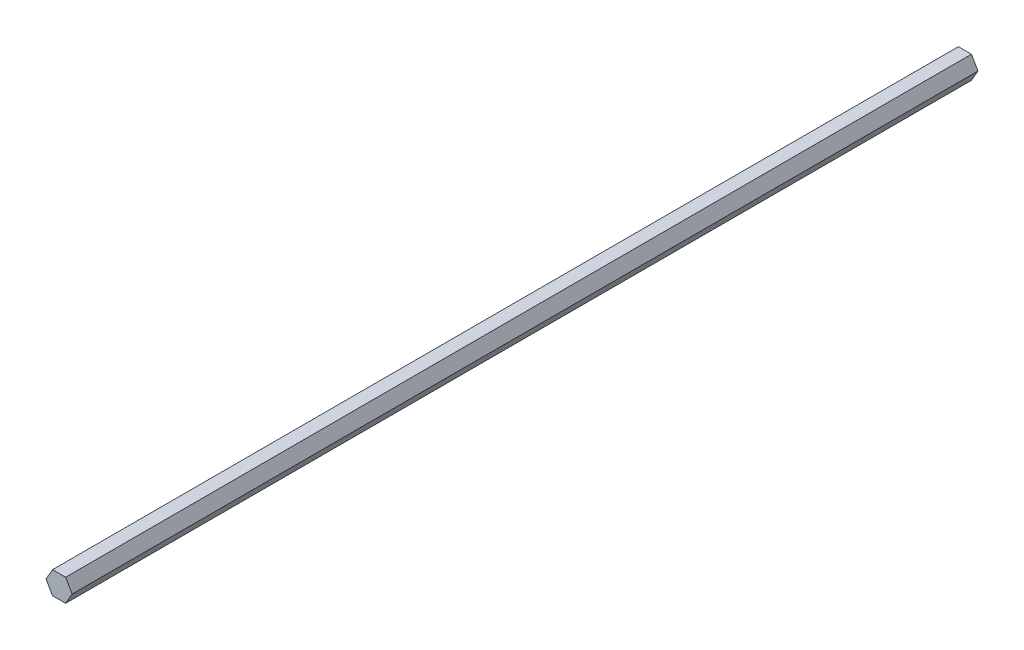
ISO-10303-21;
HEADER;
FILE_DESCRIPTION(('STEP AP214'),'2;1');
FILE_NAME('part.step','',(''),(''),'','','');
FILE_SCHEMA(('AUTOMOTIVE_DESIGN { 1 0 10303 214 1 1 1 1 }'));
ENDSEC;
DATA;
#1=APPLICATION_CONTEXT('core data for automotive mechanical design processes');
#2=APPLICATION_PROTOCOL_DEFINITION('international standard','automotive_design',2000,#1);
#3=PRODUCT_CONTEXT('',#1,'mechanical');
#4=PRODUCT('Part','Part','',(#3));
#5=PRODUCT_RELATED_PRODUCT_CATEGORY('part','',(#4));
#6=PRODUCT_DEFINITION_FORMATION('','',#4);
#7=PRODUCT_DEFINITION_CONTEXT('part definition',#1,'design');
#8=PRODUCT_DEFINITION('design','',#6,#7);
#9=PRODUCT_DEFINITION_SHAPE('','',#8);
#10=(LENGTH_UNIT() NAMED_UNIT(*) SI_UNIT(.MILLI.,.METRE.));
#11=(NAMED_UNIT(*) PLANE_ANGLE_UNIT() SI_UNIT($,.RADIAN.));
#12=(NAMED_UNIT(*) SI_UNIT($,.STERADIAN.) SOLID_ANGLE_UNIT());
#13=UNCERTAINTY_MEASURE_WITH_UNIT(LENGTH_MEASURE(1.E-05),#10,'distance_accuracy_value','');
#14=(GEOMETRIC_REPRESENTATION_CONTEXT(3) GLOBAL_UNCERTAINTY_ASSIGNED_CONTEXT((#13)) GLOBAL_UNIT_ASSIGNED_CONTEXT((#10,
#11,#12)) REPRESENTATION_CONTEXT('',''));
#15=CARTESIAN_POINT('',(0.,0.,0.));
#16=DIRECTION('',(0.,0.,1.));
#17=DIRECTION('',(1.,0.,0.));
#18=AXIS2_PLACEMENT_3D('',#15,#16,#17);
#19=CARTESIAN_POINT('',(3.6661742093542,-6.34999999999996,508.));
#20=DIRECTION('',(-0.866025403784441,0.499999999999995,0.));
#21=DIRECTION('',(-0.499999999999995,-0.866025403784441,0.));
#22=AXIS2_PLACEMENT_3D('',#19,#20,#21);
#23=PLANE('',#22);
#24=DIRECTION('',(0.499999999999995,0.866025403784441,0.));
#25=VECTOR('',#24,1.);
#26=CARTESIAN_POINT('',(3.6661742093542,-6.34999999999996,0.));
#27=LINE('',#26,#25);
#28=CARTESIAN_POINT('',(3.6661742093542,-6.34999999999996,0.));
#29=VERTEX_POINT('',#28);
#30=CARTESIAN_POINT('',(7.33234841870826,0.,0.));
#31=VERTEX_POINT('',#30);
#32=EDGE_CURVE('E120',#29,#31,#27,.T.);
#33=ORIENTED_EDGE('',*,*,#32,.T.);
#34=DIRECTION('',(0.,0.,-1.));
#35=VECTOR('',#34,1.);
#36=CARTESIAN_POINT('',(7.33234841870826,0.,508.));
#37=LINE('',#36,#35);
#38=CARTESIAN_POINT('',(7.33234841870826,0.,508.));
#39=VERTEX_POINT('',#38);
#40=EDGE_CURVE('E11',#39,#31,#37,.T.);
#41=ORIENTED_EDGE('',*,*,#40,.F.);
#42=DIRECTION('',(0.499999999999995,0.866025403784441,0.));
#43=VECTOR('',#42,1.);
#44=CARTESIAN_POINT('',(3.6661742093542,-6.34999999999996,508.));
#45=LINE('',#44,#43);
#46=CARTESIAN_POINT('',(3.6661742093542,-6.34999999999996,508.));
#47=VERTEX_POINT('',#46);
#48=EDGE_CURVE('E130',#47,#39,#45,.T.);
#49=ORIENTED_EDGE('',*,*,#48,.F.);
#50=DIRECTION('',(0.,0.,-1.));
#51=VECTOR('',#50,1.);
#52=CARTESIAN_POINT('',(3.6661742093542,-6.34999999999996,508.));
#53=LINE('',#52,#51);
#54=EDGE_CURVE('E116',#47,#29,#53,.T.);
#55=ORIENTED_EDGE('',*,*,#54,.T.);
#56=EDGE_LOOP('',(#33,#41,#49,#55));
#57=FACE_BOUND('',#56,.T.);
#58=ADVANCED_FACE('F36',(#57),#23,.F.);
#59=CARTESIAN_POINT('',(7.33234841870826,0.,508.));
#60=DIRECTION('',(-0.866025403784438,-0.500000000000001,0.));
#61=DIRECTION('',(0.500000000000001,-0.866025403784438,0.));
#62=AXIS2_PLACEMENT_3D('',#59,#60,#61);
#63=PLANE('',#62);
#64=DIRECTION('',(-0.500000000000001,0.866025403784438,0.));
#65=VECTOR('',#64,1.);
#66=CARTESIAN_POINT('',(7.33234841870826,0.,0.));
#67=LINE('',#66,#65);
#68=CARTESIAN_POINT('',(3.66617420935411,6.35000000000001,0.));
#69=VERTEX_POINT('',#68);
#70=EDGE_CURVE('E123',#31,#69,#67,.T.);
#71=ORIENTED_EDGE('',*,*,#70,.T.);
#72=DIRECTION('',(0.,0.,-1.));
#73=VECTOR('',#72,1.);
#74=CARTESIAN_POINT('',(3.66617420935411,6.35000000000001,508.));
#75=LINE('',#74,#73);
#76=CARTESIAN_POINT('',(3.66617420935411,6.35000000000001,508.));
#77=VERTEX_POINT('',#76);
#78=EDGE_CURVE('E44',#77,#69,#75,.T.);
#79=ORIENTED_EDGE('',*,*,#78,.F.);
#80=DIRECTION('',(-0.500000000000001,0.866025403784438,0.));
#81=VECTOR('',#80,1.);
#82=CARTESIAN_POINT('',(7.33234841870826,0.,508.));
#83=LINE('',#82,#81);
#84=EDGE_CURVE('E89',#39,#77,#83,.T.);
#85=ORIENTED_EDGE('',*,*,#84,.F.);
#86=ORIENTED_EDGE('',*,*,#40,.T.);
#87=EDGE_LOOP('',(#71,#79,#85,#86));
#88=FACE_BOUND('',#87,.T.);
#89=ADVANCED_FACE('F154',(#88),#63,.F.);
#90=CARTESIAN_POINT('',(3.66617420935411,6.35000000000001,508.));
#91=DIRECTION('',(0.,-1.,0.));
#92=DIRECTION('',(1.,0.,0.));
#93=AXIS2_PLACEMENT_3D('',#90,#91,#92);
#94=PLANE('',#93);
#95=DIRECTION('',(-1.,0.,0.));
#96=VECTOR('',#95,1.);
#97=CARTESIAN_POINT('',(3.66617420935411,6.35000000000001,0.));
#98=LINE('',#97,#96);
#99=CARTESIAN_POINT('',(-3.66617420935416,6.34999999999999,0.));
#100=VERTEX_POINT('',#99);
#101=EDGE_CURVE('E125',#69,#100,#98,.T.);
#102=ORIENTED_EDGE('',*,*,#101,.T.);
#103=DIRECTION('',(0.,0.,-1.));
#104=VECTOR('',#103,1.);
#105=CARTESIAN_POINT('',(-3.66617420935416,6.34999999999999,508.));
#106=LINE('',#105,#104);
#107=CARTESIAN_POINT('',(-3.66617420935416,6.34999999999999,508.));
#108=VERTEX_POINT('',#107);
#109=EDGE_CURVE('E111',#108,#100,#106,.T.);
#110=ORIENTED_EDGE('',*,*,#109,.F.);
#111=DIRECTION('',(-1.,0.,0.));
#112=VECTOR('',#111,1.);
#113=CARTESIAN_POINT('',(3.66617420935411,6.35000000000001,508.));
#114=LINE('',#113,#112);
#115=EDGE_CURVE('E102',#77,#108,#114,.T.);
#116=ORIENTED_EDGE('',*,*,#115,.F.);
#117=ORIENTED_EDGE('',*,*,#78,.T.);
#118=EDGE_LOOP('',(#102,#110,#116,#117));
#119=FACE_BOUND('',#118,.T.);
#120=ADVANCED_FACE('F136',(#119),#94,.F.);
#121=CARTESIAN_POINT('',(-3.66617420935416,6.34999999999999,508.));
#122=DIRECTION('',(0.866025403784442,-0.499999999999995,0.));
#123=DIRECTION('',(0.499999999999995,0.866025403784442,0.));
#124=AXIS2_PLACEMENT_3D('',#121,#122,#123);
#125=PLANE('',#124);
#126=DIRECTION('',(-0.499999999999995,-0.866025403784442,0.));
#127=VECTOR('',#126,1.);
#128=CARTESIAN_POINT('',(-3.66617420935416,6.34999999999999,0.));
#129=LINE('',#128,#127);
#130=CARTESIAN_POINT('',(-7.33234841870825,0.,0.));
#131=VERTEX_POINT('',#130);
#132=EDGE_CURVE('E110',#100,#131,#129,.T.);
#133=ORIENTED_EDGE('',*,*,#132,.T.);
#134=DIRECTION('',(0.,0.,-1.));
#135=VECTOR('',#134,1.);
#136=CARTESIAN_POINT('',(-7.33234841870825,0.,508.));
#137=LINE('',#136,#135);
#138=CARTESIAN_POINT('',(-7.33234841870825,0.,508.));
#139=VERTEX_POINT('',#138);
#140=EDGE_CURVE('E107',#139,#131,#137,.T.);
#141=ORIENTED_EDGE('',*,*,#140,.F.);
#142=DIRECTION('',(-0.499999999999995,-0.866025403784442,0.));
#143=VECTOR('',#142,1.);
#144=CARTESIAN_POINT('',(-3.66617420935416,6.34999999999999,508.));
#145=LINE('',#144,#143);
#146=EDGE_CURVE('E96',#108,#139,#145,.T.);
#147=ORIENTED_EDGE('',*,*,#146,.F.);
#148=ORIENTED_EDGE('',*,*,#109,.T.);
#149=EDGE_LOOP('',(#133,#141,#147,#148));
#150=FACE_BOUND('',#149,.T.);
#151=ADVANCED_FACE('F108',(#150),#125,.F.);
#152=CARTESIAN_POINT('',(-7.33234841870825,0.,508.));
#153=DIRECTION('',(0.866025403784434,0.500000000000007,0.));
#154=DIRECTION('',(-0.500000000000007,0.866025403784435,0.));
#155=AXIS2_PLACEMENT_3D('',#152,#153,#154);
#156=PLANE('',#155);
#157=DIRECTION('',(0.500000000000007,-0.866025403784434,0.));
#158=VECTOR('',#157,1.);
#159=CARTESIAN_POINT('',(-7.33234841870825,0.,0.));
#160=LINE('',#159,#158);
#161=CARTESIAN_POINT('',(-3.66617420935407,-6.35000000000004,0.));
#162=VERTEX_POINT('',#161);
#163=EDGE_CURVE('E75',#131,#162,#160,.T.);
#164=ORIENTED_EDGE('',*,*,#163,.T.);
#165=DIRECTION('',(0.,0.,-1.));
#166=VECTOR('',#165,1.);
#167=CARTESIAN_POINT('',(-3.66617420935407,-6.35000000000004,508.));
#168=LINE('',#167,#166);
#169=CARTESIAN_POINT('',(-3.66617420935407,-6.35000000000004,508.));
#170=VERTEX_POINT('',#169);
#171=EDGE_CURVE('E112',#170,#162,#168,.T.);
#172=ORIENTED_EDGE('',*,*,#171,.F.);
#173=DIRECTION('',(0.500000000000007,-0.866025403784434,0.));
#174=VECTOR('',#173,1.);
#175=CARTESIAN_POINT('',(-7.33234841870825,0.,508.));
#176=LINE('',#175,#174);
#177=EDGE_CURVE('E100',#139,#170,#176,.T.);
#178=ORIENTED_EDGE('',*,*,#177,.F.);
#179=ORIENTED_EDGE('',*,*,#140,.T.);
#180=EDGE_LOOP('',(#164,#172,#178,#179));
#181=FACE_BOUND('',#180,.T.);
#182=ADVANCED_FACE('F114',(#181),#156,.F.);
#183=CARTESIAN_POINT('',(-3.66617420935407,-6.35000000000004,508.));
#184=DIRECTION('',(0.,1.,0.));
#185=DIRECTION('',(-1.,0.,0.));
#186=AXIS2_PLACEMENT_3D('',#183,#184,#185);
#187=PLANE('',#186);
#188=DIRECTION('',(1.,0.,0.));
#189=VECTOR('',#188,1.);
#190=CARTESIAN_POINT('',(-3.66617420935407,-6.35000000000004,0.));
#191=LINE('',#190,#189);
#192=EDGE_CURVE('E81',#162,#29,#191,.T.);
#193=ORIENTED_EDGE('',*,*,#192,.T.);
#194=ORIENTED_EDGE('',*,*,#54,.F.);
#195=DIRECTION('',(1.,0.,0.));
#196=VECTOR('',#195,1.);
#197=CARTESIAN_POINT('',(-3.66617420935407,-6.35000000000004,508.));
#198=LINE('',#197,#196);
#199=EDGE_CURVE('E52',#170,#47,#198,.T.);
#200=ORIENTED_EDGE('',*,*,#199,.F.);
#201=ORIENTED_EDGE('',*,*,#171,.T.);
#202=EDGE_LOOP('',(#193,#194,#200,#201));
#203=FACE_BOUND('',#202,.T.);
#204=ADVANCED_FACE('F143',(#203),#187,.F.);
#205=CARTESIAN_POINT('',(0.,0.,508.));
#206=DIRECTION('',(0.,0.,1.));
#207=DIRECTION('',(1.,0.,0.));
#208=AXIS2_PLACEMENT_3D('',#205,#206,#207);
#209=PLANE('',#208);
#210=ORIENTED_EDGE('',*,*,#48,.T.);
#211=ORIENTED_EDGE('',*,*,#84,.T.);
#212=ORIENTED_EDGE('',*,*,#115,.T.);
#213=ORIENTED_EDGE('',*,*,#146,.T.);
#214=ORIENTED_EDGE('',*,*,#177,.T.);
#215=ORIENTED_EDGE('',*,*,#199,.T.);
#216=EDGE_LOOP('',(#210,#211,#212,#213,#214,#215));
#217=FACE_BOUND('',#216,.T.);
#218=ADVANCED_FACE('F98',(#217),#209,.T.);
#219=CARTESIAN_POINT('',(0.,0.,0.));
#220=DIRECTION('',(0.,0.,1.));
#221=DIRECTION('',(1.,0.,0.));
#222=AXIS2_PLACEMENT_3D('',#219,#220,#221);
#223=PLANE('',#222);
#224=ORIENTED_EDGE('',*,*,#32,.F.);
#225=ORIENTED_EDGE('',*,*,#192,.F.);
#226=ORIENTED_EDGE('',*,*,#163,.F.);
#227=ORIENTED_EDGE('',*,*,#132,.F.);
#228=ORIENTED_EDGE('',*,*,#101,.F.);
#229=ORIENTED_EDGE('',*,*,#70,.F.);
#230=EDGE_LOOP('',(#224,#225,#226,#227,#228,#229));
#231=FACE_BOUND('',#230,.T.);
#232=ADVANCED_FACE('F139',(#231),#223,.F.);
#233=CLOSED_SHELL('',(#58,#89,#120,#151,#182,#204,#218,#232));
#234=MANIFOLD_SOLID_BREP('B2',#233);
#235=ADVANCED_BREP_SHAPE_REPRESENTATION('',(#18,#234),#14);
#236=SHAPE_DEFINITION_REPRESENTATION(#9,#235);
ENDSEC;
END-ISO-10303-21;
